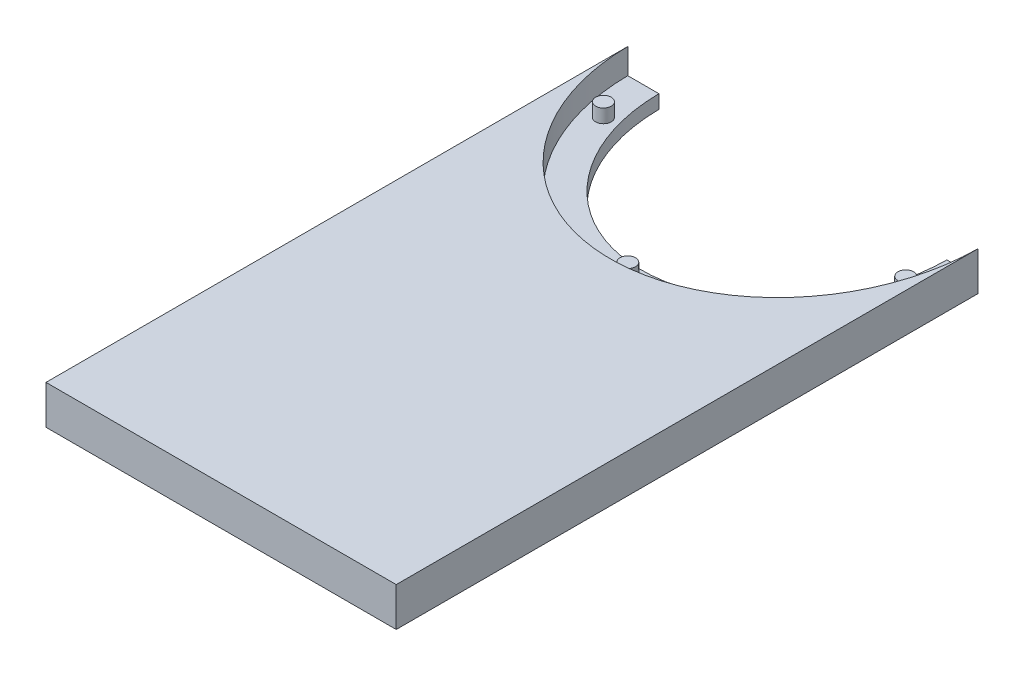
ISO-10303-21;
HEADER;
FILE_DESCRIPTION(('STEP AP214'),'2;1');
FILE_NAME('part.step','',(''),(''),'','','');
FILE_SCHEMA(('AUTOMOTIVE_DESIGN { 1 0 10303 214 1 1 1 1 }'));
ENDSEC;
DATA;
#1=APPLICATION_CONTEXT('core data for automotive mechanical design processes');
#2=APPLICATION_PROTOCOL_DEFINITION('international standard','automotive_design',2000,#1);
#3=PRODUCT_CONTEXT('',#1,'mechanical');
#4=PRODUCT('Part','Part','',(#3));
#5=PRODUCT_RELATED_PRODUCT_CATEGORY('part','',(#4));
#6=PRODUCT_DEFINITION_FORMATION('','',#4);
#7=PRODUCT_DEFINITION_CONTEXT('part definition',#1,'design');
#8=PRODUCT_DEFINITION('design','',#6,#7);
#9=PRODUCT_DEFINITION_SHAPE('','',#8);
#10=(LENGTH_UNIT() NAMED_UNIT(*) SI_UNIT(.MILLI.,.METRE.));
#11=(NAMED_UNIT(*) PLANE_ANGLE_UNIT() SI_UNIT($,.RADIAN.));
#12=(NAMED_UNIT(*) SI_UNIT($,.STERADIAN.) SOLID_ANGLE_UNIT());
#13=UNCERTAINTY_MEASURE_WITH_UNIT(LENGTH_MEASURE(1.E-05),#10,'distance_accuracy_value','');
#14=(GEOMETRIC_REPRESENTATION_CONTEXT(3) GLOBAL_UNCERTAINTY_ASSIGNED_CONTEXT((#13)) GLOBAL_UNIT_ASSIGNED_CONTEXT((#10,
#11,#12)) REPRESENTATION_CONTEXT('',''));
#15=CARTESIAN_POINT('',(0.,0.,0.));
#16=DIRECTION('',(0.,0.,1.));
#17=DIRECTION('',(1.,0.,0.));
#18=AXIS2_PLACEMENT_3D('',#15,#16,#17);
#19=CARTESIAN_POINT('',(0.,10.,0.));
#20=DIRECTION('',(0.,1.,0.));
#21=DIRECTION('',(0.,0.,1.));
#22=AXIS2_PLACEMENT_3D('',#19,#20,#21);
#23=ELLIPSE('',#22,50.,45.);
#24=DIRECTION('',(0.,-1.,0.));
#25=VECTOR('',#24,1.);
#26=SURFACE_OF_LINEAR_EXTRUSION('',#23,#25);
#27=CARTESIAN_POINT('',(0.,3.5,0.));
#28=DIRECTION('',(0.,1.,0.));
#29=DIRECTION('',(0.,0.,1.));
#30=AXIS2_PLACEMENT_3D('',#27,#28,#29);
#31=ELLIPSE('',#30,50.,45.);
#32=CARTESIAN_POINT('',(-44.9977499437472,3.5,0.5));
#33=VERTEX_POINT('',#32);
#34=CARTESIAN_POINT('',(44.9977499437472,3.5,0.5));
#35=VERTEX_POINT('',#34);
#36=EDGE_CURVE('E156',#33,#35,#31,.T.);
#37=ORIENTED_EDGE('',*,*,#36,.F.);
#38=DIRECTION('',(0.,-1.,0.));
#39=VECTOR('',#38,1.);
#40=CARTESIAN_POINT('',(-44.9977499437472,10.,0.5));
#41=LINE('',#40,#39);
#42=CARTESIAN_POINT('',(-44.9977499437472,10.,0.5));
#43=VERTEX_POINT('',#42);
#44=EDGE_CURVE('E55',#43,#33,#41,.T.);
#45=ORIENTED_EDGE('',*,*,#44,.F.);
#46=CARTESIAN_POINT('',(44.9977499437472,10.,0.5));
#47=VERTEX_POINT('',#46);
#48=EDGE_CURVE('E245',#43,#47,#23,.T.);
#49=ORIENTED_EDGE('',*,*,#48,.T.);
#50=DIRECTION('',(0.,-1.,0.));
#51=VECTOR('',#50,1.);
#52=CARTESIAN_POINT('',(44.9977499437472,10.,0.5));
#53=LINE('',#52,#51);
#54=EDGE_CURVE('E63',#47,#35,#53,.T.);
#55=ORIENTED_EDGE('',*,*,#54,.T.);
#56=EDGE_LOOP('',(#37,#45,#49,#55));
#57=FACE_BOUND('',#56,.T.);
#58=ADVANCED_FACE('F45',(#57),#26,.T.);
#59=CARTESIAN_POINT('',(0.,10.,0.5));
#60=DIRECTION('',(0.,0.,-1.));
#61=DIRECTION('',(-1.,0.,0.));
#62=AXIS2_PLACEMENT_3D('',#59,#60,#61);
#63=PLANE('',#62);
#64=DIRECTION('',(1.,0.,0.));
#65=VECTOR('',#64,1.);
#66=CARTESIAN_POINT('',(0.,0.,0.5));
#67=LINE('',#66,#65);
#68=CARTESIAN_POINT('',(-45.,0.,0.5));
#69=VERTEX_POINT('',#68);
#70=CARTESIAN_POINT('',(-36.9973577680352,0.,0.5));
#71=VERTEX_POINT('',#70);
#72=EDGE_CURVE('E134',#69,#71,#67,.T.);
#73=ORIENTED_EDGE('',*,*,#72,.F.);
#74=DIRECTION('',(0.,-1.,0.));
#75=VECTOR('',#74,1.);
#76=CARTESIAN_POINT('',(-45.,10.,0.5));
#77=LINE('',#76,#75);
#78=CARTESIAN_POINT('',(-45.,10.,0.5));
#79=VERTEX_POINT('',#78);
#80=EDGE_CURVE('E232',#79,#69,#77,.T.);
#81=ORIENTED_EDGE('',*,*,#80,.F.);
#82=DIRECTION('',(1.,0.,0.));
#83=VECTOR('',#82,1.);
#84=CARTESIAN_POINT('',(0.,10.,0.5));
#85=LINE('',#84,#83);
#86=EDGE_CURVE('E131',#79,#43,#85,.T.);
#87=ORIENTED_EDGE('',*,*,#86,.T.);
#88=ORIENTED_EDGE('',*,*,#44,.T.);
#89=DIRECTION('',(1.,0.,0.));
#90=VECTOR('',#89,1.);
#91=CARTESIAN_POINT('',(0.,3.5,0.5));
#92=LINE('',#91,#90);
#93=CARTESIAN_POINT('',(-36.9973577680352,3.5,0.5));
#94=VERTEX_POINT('',#93);
#95=EDGE_CURVE('E161',#33,#94,#92,.T.);
#96=ORIENTED_EDGE('',*,*,#95,.T.);
#97=DIRECTION('',(0.,-1.,0.));
#98=VECTOR('',#97,1.);
#99=CARTESIAN_POINT('',(-36.9973577680352,3.5,0.5));
#100=LINE('',#99,#98);
#101=EDGE_CURVE('E160',#94,#71,#100,.T.);
#102=ORIENTED_EDGE('',*,*,#101,.T.);
#103=EDGE_LOOP('',(#73,#81,#87,#88,#96,#102));
#104=FACE_BOUND('',#103,.T.);
#105=ADVANCED_FACE('F207',(#104),#63,.T.);
#106=CARTESIAN_POINT('',(-45.,10.,0.));
#107=DIRECTION('',(-1.,0.,0.));
#108=DIRECTION('',(0.,0.,1.));
#109=AXIS2_PLACEMENT_3D('',#106,#107,#108);
#110=PLANE('',#109);
#111=DIRECTION('',(0.,0.,-1.));
#112=VECTOR('',#111,1.);
#113=CARTESIAN_POINT('',(-45.,0.,0.));
#114=LINE('',#113,#112);
#115=CARTESIAN_POINT('',(-45.,0.,150.));
#116=VERTEX_POINT('',#115);
#117=EDGE_CURVE('E138',#116,#69,#114,.T.);
#118=ORIENTED_EDGE('',*,*,#117,.F.);
#119=DIRECTION('',(0.,-1.,0.));
#120=VECTOR('',#119,1.);
#121=CARTESIAN_POINT('',(-45.,10.,150.));
#122=LINE('',#121,#120);
#123=CARTESIAN_POINT('',(-45.,10.,150.));
#124=VERTEX_POINT('',#123);
#125=EDGE_CURVE('E123',#124,#116,#122,.T.);
#126=ORIENTED_EDGE('',*,*,#125,.F.);
#127=DIRECTION('',(0.,0.,-1.));
#128=VECTOR('',#127,1.);
#129=CARTESIAN_POINT('',(-45.,10.,0.));
#130=LINE('',#129,#128);
#131=EDGE_CURVE('E115',#124,#79,#130,.T.);
#132=ORIENTED_EDGE('',*,*,#131,.T.);
#133=ORIENTED_EDGE('',*,*,#80,.T.);
#134=EDGE_LOOP('',(#118,#126,#132,#133));
#135=FACE_BOUND('',#134,.T.);
#136=ADVANCED_FACE('F211',(#135),#110,.T.);
#137=CARTESIAN_POINT('',(0.,10.,150.));
#138=DIRECTION('',(0.,0.,-1.));
#139=DIRECTION('',(-1.,0.,0.));
#140=AXIS2_PLACEMENT_3D('',#137,#138,#139);
#141=PLANE('',#140);
#142=DIRECTION('',(1.,0.,0.));
#143=VECTOR('',#142,1.);
#144=CARTESIAN_POINT('',(0.,0.,150.));
#145=LINE('',#144,#143);
#146=CARTESIAN_POINT('',(45.,0.,150.));
#147=VERTEX_POINT('',#146);
#148=EDGE_CURVE('E81',#116,#147,#145,.T.);
#149=ORIENTED_EDGE('',*,*,#148,.T.);
#150=DIRECTION('',(0.,-1.,0.));
#151=VECTOR('',#150,1.);
#152=CARTESIAN_POINT('',(45.,10.,150.));
#153=LINE('',#152,#151);
#154=CARTESIAN_POINT('',(45.,10.,150.));
#155=VERTEX_POINT('',#154);
#156=EDGE_CURVE('E118',#155,#147,#153,.T.);
#157=ORIENTED_EDGE('',*,*,#156,.F.);
#158=DIRECTION('',(1.,0.,0.));
#159=VECTOR('',#158,1.);
#160=CARTESIAN_POINT('',(0.,10.,150.));
#161=LINE('',#160,#159);
#162=EDGE_CURVE('E108',#124,#155,#161,.T.);
#163=ORIENTED_EDGE('',*,*,#162,.F.);
#164=ORIENTED_EDGE('',*,*,#125,.T.);
#165=EDGE_LOOP('',(#149,#157,#163,#164));
#166=FACE_BOUND('',#165,.T.);
#167=ADVANCED_FACE('F119',(#166),#141,.F.);
#168=CARTESIAN_POINT('',(45.,10.,0.));
#169=DIRECTION('',(-1.,0.,0.));
#170=DIRECTION('',(0.,0.,1.));
#171=AXIS2_PLACEMENT_3D('',#168,#169,#170);
#172=PLANE('',#171);
#173=DIRECTION('',(0.,0.,-1.));
#174=VECTOR('',#173,1.);
#175=CARTESIAN_POINT('',(45.,0.,0.));
#176=LINE('',#175,#174);
#177=CARTESIAN_POINT('',(45.,0.,0.5));
#178=VERTEX_POINT('',#177);
#179=EDGE_CURVE('E146',#147,#178,#176,.T.);
#180=ORIENTED_EDGE('',*,*,#179,.T.);
#181=DIRECTION('',(0.,-1.,0.));
#182=VECTOR('',#181,1.);
#183=CARTESIAN_POINT('',(45.,10.,0.5));
#184=LINE('',#183,#182);
#185=CARTESIAN_POINT('',(45.,10.,0.5));
#186=VERTEX_POINT('',#185);
#187=EDGE_CURVE('E87',#186,#178,#184,.T.);
#188=ORIENTED_EDGE('',*,*,#187,.F.);
#189=DIRECTION('',(0.,0.,-1.));
#190=VECTOR('',#189,1.);
#191=CARTESIAN_POINT('',(45.,10.,0.));
#192=LINE('',#191,#190);
#193=EDGE_CURVE('E112',#155,#186,#192,.T.);
#194=ORIENTED_EDGE('',*,*,#193,.F.);
#195=ORIENTED_EDGE('',*,*,#156,.T.);
#196=EDGE_LOOP('',(#180,#188,#194,#195));
#197=FACE_BOUND('',#196,.T.);
#198=ADVANCED_FACE('F125',(#197),#172,.F.);
#199=CARTESIAN_POINT('',(36.9973577680352,0.,0.5));
#200=VERTEX_POINT('',#199);
#201=EDGE_CURVE('E140',#200,#178,#67,.T.);
#202=ORIENTED_EDGE('',*,*,#201,.F.);
#203=DIRECTION('',(0.,-1.,0.));
#204=VECTOR('',#203,1.);
#205=CARTESIAN_POINT('',(36.9973577680352,3.5,0.5));
#206=LINE('',#205,#204);
#207=CARTESIAN_POINT('',(36.9973577680352,3.5,0.5));
#208=VERTEX_POINT('',#207);
#209=EDGE_CURVE('E139',#208,#200,#206,.T.);
#210=ORIENTED_EDGE('',*,*,#209,.F.);
#211=EDGE_CURVE('E169',#208,#35,#92,.T.);
#212=ORIENTED_EDGE('',*,*,#211,.T.);
#213=ORIENTED_EDGE('',*,*,#54,.F.);
#214=EDGE_CURVE('E127',#47,#186,#85,.T.);
#215=ORIENTED_EDGE('',*,*,#214,.T.);
#216=ORIENTED_EDGE('',*,*,#187,.T.);
#217=EDGE_LOOP('',(#202,#210,#212,#213,#215,#216));
#218=FACE_BOUND('',#217,.T.);
#219=ADVANCED_FACE('F201',(#218),#63,.T.);
#220=CARTESIAN_POINT('',(0.,10.,0.));
#221=DIRECTION('',(0.,1.,0.));
#222=DIRECTION('',(0.,0.,1.));
#223=AXIS2_PLACEMENT_3D('',#220,#221,#222);
#224=PLANE('',#223);
#225=ORIENTED_EDGE('',*,*,#48,.F.);
#226=ORIENTED_EDGE('',*,*,#86,.F.);
#227=ORIENTED_EDGE('',*,*,#131,.F.);
#228=ORIENTED_EDGE('',*,*,#162,.T.);
#229=ORIENTED_EDGE('',*,*,#193,.T.);
#230=ORIENTED_EDGE('',*,*,#214,.F.);
#231=EDGE_LOOP('',(#225,#226,#227,#228,#229,#230));
#232=FACE_BOUND('',#231,.T.);
#233=ADVANCED_FACE('F109',(#232),#224,.T.);
#234=CARTESIAN_POINT('',(0.,0.,0.));
#235=DIRECTION('',(0.,1.,0.));
#236=DIRECTION('',(0.,0.,1.));
#237=AXIS2_PLACEMENT_3D('',#234,#235,#236);
#238=PLANE('',#237);
#239=ORIENTED_EDGE('',*,*,#72,.T.);
#240=CARTESIAN_POINT('',(0.,0.,-42.));
#241=CARTESIAN_POINT('',(-4.93138164351082,0.,-42.));
#242=CARTESIAN_POINT('',(-14.7941449305325,0.,-39.7237391442364));
#243=CARTESIAN_POINT('',(-27.0896008441229,0.,-30.2004855000218));
#244=CARTESIAN_POINT('',(-35.1368792596779,0.,-16.2564691599312));
#245=CARTESIAN_POINT('',(-37.931560370161,0.,0.));
#246=CARTESIAN_POINT('',(-35.1368792596779,0.,16.2564691599312));
#247=CARTESIAN_POINT('',(-27.0896008441229,0.,30.2004855000218));
#248=CARTESIAN_POINT('',(-14.7941449305325,0.,39.7237391442364));
#249=CARTESIAN_POINT('',(0.,0.,43.1381304278818));
#250=CARTESIAN_POINT('',(14.7941449305325,0.,39.7237391442364));
#251=CARTESIAN_POINT('',(27.0896008441229,0.,30.2004855000219));
#252=CARTESIAN_POINT('',(35.1368792596779,0.,16.2564691599312));
#253=CARTESIAN_POINT('',(37.931560370161,0.,0.));
#254=CARTESIAN_POINT('',(35.1368792596779,0.,-16.2564691599312));
#255=CARTESIAN_POINT('',(27.0896008441229,0.,-30.2004855000218));
#256=CARTESIAN_POINT('',(14.7941449305325,0.,-39.7237391442364));
#257=CARTESIAN_POINT('',(4.93138164351083,0.,-42.));
#258=CARTESIAN_POINT('',(0.,0.,-42.));
#259=B_SPLINE_CURVE_WITH_KNOTS('',3,(#240,#241,#242,#243,#244,#245,#246,#247,#248,#249,#250,
#251,#252,#253,#254,#255,#256,#257,#258),.UNSPECIFIED.,.T.,.F.,(4,1,1,1,1,1,1,1,1,1,1,1,1,1,1,1,
4),(0.,0.392699081698724,0.785398163397448,1.17809724509617,1.5707963267949,1.96349540849362,
2.35619449019234,2.74889357189107,3.14159265358979,3.53429173528852,3.92699081698724,
4.31968989868597,4.71238898038469,5.10508806208341,5.49778714378214,5.89048622548086,
6.28318530717959),.UNSPECIFIED.);
#260=EDGE_CURVE('E183',#71,#200,#259,.T.);
#261=ORIENTED_EDGE('',*,*,#260,.T.);
#262=ORIENTED_EDGE('',*,*,#201,.T.);
#263=ORIENTED_EDGE('',*,*,#179,.F.);
#264=ORIENTED_EDGE('',*,*,#148,.F.);
#265=ORIENTED_EDGE('',*,*,#117,.T.);
#266=EDGE_LOOP('',(#239,#261,#262,#263,#264,#265));
#267=FACE_BOUND('',#266,.T.);
#268=ADVANCED_FACE('F196',(#267),#238,.F.);
#269=CARTESIAN_POINT('',(0.,3.5,-42.));
#270=CARTESIAN_POINT('',(-4.93138164351082,3.5,-42.));
#271=CARTESIAN_POINT('',(-14.7941449305325,3.5,-39.7237391442364));
#272=CARTESIAN_POINT('',(-27.0896008441229,3.5,-30.2004855000218));
#273=CARTESIAN_POINT('',(-35.1368792596779,3.5,-16.2564691599312));
#274=CARTESIAN_POINT('',(-37.931560370161,3.5,0.));
#275=CARTESIAN_POINT('',(-35.1368792596779,3.5,16.2564691599312));
#276=CARTESIAN_POINT('',(-27.0896008441229,3.5,30.2004855000218));
#277=CARTESIAN_POINT('',(-14.7941449305325,3.5,39.7237391442364));
#278=CARTESIAN_POINT('',(0.,3.5,43.1381304278818));
#279=CARTESIAN_POINT('',(14.7941449305325,3.5,39.7237391442364));
#280=CARTESIAN_POINT('',(27.0896008441229,3.5,30.2004855000219));
#281=CARTESIAN_POINT('',(35.1368792596779,3.5,16.2564691599312));
#282=CARTESIAN_POINT('',(37.931560370161,3.5,0.));
#283=CARTESIAN_POINT('',(35.1368792596779,3.5,-16.2564691599312));
#284=CARTESIAN_POINT('',(27.0896008441229,3.5,-30.2004855000218));
#285=CARTESIAN_POINT('',(14.7941449305325,3.5,-39.7237391442364));
#286=CARTESIAN_POINT('',(4.93138164351083,3.5,-42.));
#287=CARTESIAN_POINT('',(0.,3.5,-42.));
#288=B_SPLINE_CURVE_WITH_KNOTS('',3,(#269,#270,#271,#272,#273,#274,#275,#276,#277,#278,#279,
#280,#281,#282,#283,#284,#285,#286,#287),.UNSPECIFIED.,.T.,.F.,(4,1,1,1,1,1,1,1,1,1,1,1,1,1,1,1,
4),(0.,0.392699081698724,0.785398163397448,1.17809724509617,1.5707963267949,1.96349540849362,
2.35619449019234,2.74889357189107,3.14159265358979,3.53429173528852,3.92699081698724,
4.31968989868597,4.71238898038469,5.10508806208341,5.49778714378214,5.89048622548086,
6.28318530717959),.UNSPECIFIED.);
#289=DIRECTION('',(0.,-1.,0.));
#290=VECTOR('',#289,1.);
#291=SURFACE_OF_LINEAR_EXTRUSION('',#288,#290);
#292=ORIENTED_EDGE('',*,*,#260,.F.);
#293=ORIENTED_EDGE('',*,*,#101,.F.);
#294=EDGE_CURVE('E168',#94,#208,#288,.T.);
#295=ORIENTED_EDGE('',*,*,#294,.T.);
#296=ORIENTED_EDGE('',*,*,#209,.T.);
#297=EDGE_LOOP('',(#292,#293,#295,#296));
#298=FACE_BOUND('',#297,.T.);
#299=ADVANCED_FACE('F191',(#298),#291,.T.);
#300=CARTESIAN_POINT('',(0.,3.5,0.));
#301=DIRECTION('',(0.,1.,0.));
#302=DIRECTION('',(0.,0.,1.));
#303=AXIS2_PLACEMENT_3D('',#300,#301,#302);
#304=PLANE('',#303);
#305=CARTESIAN_POINT('',(38.8404838015386,3.5,12.9089643673815));
#306=DIRECTION('',(0.,1.,0.));
#307=DIRECTION('',(0.,0.,1.));
#308=AXIS2_PLACEMENT_3D('',#305,#306,#307);
#309=CIRCLE('',#308,2.);
#310=CARTESIAN_POINT('',(38.8404838015386,3.5,14.9089643673815));
#311=VERTEX_POINT('',#310);
#312=EDGE_CURVE('E11',#311,#311,#309,.T.);
#313=ORIENTED_EDGE('',*,*,#312,.F.);
#314=EDGE_LOOP('',(#313));
#315=FACE_BOUND('',#314,.T.);
#316=CARTESIAN_POINT('',(0.,3.5,45.5));
#317=DIRECTION('',(0.,1.,0.));
#318=DIRECTION('',(0.,0.,1.));
#319=AXIS2_PLACEMENT_3D('',#316,#317,#318);
#320=CIRCLE('',#319,2.);
#321=CARTESIAN_POINT('',(0.,3.5,47.5));
#322=VERTEX_POINT('',#321);
#323=EDGE_CURVE('E265',#322,#322,#320,.F.);
#324=ORIENTED_EDGE('',*,*,#323,.T.);
#325=EDGE_LOOP('',(#324));
#326=FACE_BOUND('',#325,.T.);
#327=CARTESIAN_POINT('',(-38.8404838015386,3.5,12.9089643673815));
#328=DIRECTION('',(0.,1.,0.));
#329=DIRECTION('',(0.,0.,1.));
#330=AXIS2_PLACEMENT_3D('',#327,#328,#329);
#331=CIRCLE('',#330,2.);
#332=CARTESIAN_POINT('',(-38.8404838015386,3.5,14.9089643673815));
#333=VERTEX_POINT('',#332);
#334=EDGE_CURVE('E257',#333,#333,#331,.F.);
#335=ORIENTED_EDGE('',*,*,#334,.T.);
#336=EDGE_LOOP('',(#335));
#337=FACE_BOUND('',#336,.T.);
#338=ORIENTED_EDGE('',*,*,#211,.F.);
#339=ORIENTED_EDGE('',*,*,#294,.F.);
#340=ORIENTED_EDGE('',*,*,#95,.F.);
#341=ORIENTED_EDGE('',*,*,#36,.T.);
#342=EDGE_LOOP('',(#338,#339,#340,#341));
#343=FACE_BOUND('',#342,.T.);
#344=ADVANCED_FACE('F195',(#315,#326,#337,#343),#304,.T.);
#345=CARTESIAN_POINT('',(-38.8404838015386,7.,12.9089643673815));
#346=DIRECTION('',(0.,-1.,0.));
#347=DIRECTION('',(0.,0.,-1.));
#348=AXIS2_PLACEMENT_3D('',#345,#346,#347);
#349=CYLINDRICAL_SURFACE('',#348,2.);
#350=ORIENTED_EDGE('',*,*,#334,.F.);
#351=EDGE_LOOP('',(#350));
#352=FACE_BOUND('',#351,.T.);
#353=CARTESIAN_POINT('',(-38.8404838015386,7.,12.9089643673815));
#354=DIRECTION('',(0.,1.,0.));
#355=DIRECTION('',(0.,0.,1.));
#356=AXIS2_PLACEMENT_3D('',#353,#354,#355);
#357=CIRCLE('',#356,2.);
#358=CARTESIAN_POINT('',(-38.8404838015386,7.,14.9089643673815));
#359=VERTEX_POINT('',#358);
#360=EDGE_CURVE('E174',#359,#359,#357,.T.);
#361=ORIENTED_EDGE('',*,*,#360,.F.);
#362=EDGE_LOOP('',(#361));
#363=FACE_BOUND('',#362,.T.);
#364=ADVANCED_FACE('F301',(#352,#363),#349,.T.);
#365=CARTESIAN_POINT('',(-38.8404838015386,7.,12.9089643673815));
#366=DIRECTION('',(0.,1.,0.));
#367=DIRECTION('',(0.,0.,1.));
#368=AXIS2_PLACEMENT_3D('',#365,#366,#367);
#369=PLANE('',#368);
#370=ORIENTED_EDGE('',*,*,#360,.T.);
#371=EDGE_LOOP('',(#370));
#372=FACE_BOUND('',#371,.T.);
#373=ADVANCED_FACE('F296',(#372),#369,.T.);
#374=CARTESIAN_POINT('',(0.,7.,45.5));
#375=DIRECTION('',(0.,-1.,0.));
#376=DIRECTION('',(0.,0.,-1.));
#377=AXIS2_PLACEMENT_3D('',#374,#375,#376);
#378=CYLINDRICAL_SURFACE('',#377,2.);
#379=ORIENTED_EDGE('',*,*,#323,.F.);
#380=EDGE_LOOP('',(#379));
#381=FACE_BOUND('',#380,.T.);
#382=CARTESIAN_POINT('',(0.,7.,45.5));
#383=DIRECTION('',(0.,1.,0.));
#384=DIRECTION('',(0.,0.,1.));
#385=AXIS2_PLACEMENT_3D('',#382,#383,#384);
#386=CIRCLE('',#385,2.);
#387=CARTESIAN_POINT('',(0.,7.,47.5));
#388=VERTEX_POINT('',#387);
#389=EDGE_CURVE('E268',#388,#388,#386,.T.);
#390=ORIENTED_EDGE('',*,*,#389,.F.);
#391=EDGE_LOOP('',(#390));
#392=FACE_BOUND('',#391,.T.);
#393=ADVANCED_FACE('F293',(#381,#392),#378,.T.);
#394=CARTESIAN_POINT('',(0.,7.,45.5));
#395=DIRECTION('',(0.,1.,0.));
#396=DIRECTION('',(0.,0.,1.));
#397=AXIS2_PLACEMENT_3D('',#394,#395,#396);
#398=PLANE('',#397);
#399=ORIENTED_EDGE('',*,*,#389,.T.);
#400=EDGE_LOOP('',(#399));
#401=FACE_BOUND('',#400,.T.);
#402=ADVANCED_FACE('F289',(#401),#398,.T.);
#403=CARTESIAN_POINT('',(38.8404838015386,7.,12.9089643673815));
#404=DIRECTION('',(0.,-1.,0.));
#405=DIRECTION('',(0.,0.,-1.));
#406=AXIS2_PLACEMENT_3D('',#403,#404,#405);
#407=CYLINDRICAL_SURFACE('',#406,2.);
#408=ORIENTED_EDGE('',*,*,#312,.T.);
#409=EDGE_LOOP('',(#408));
#410=FACE_BOUND('',#409,.T.);
#411=CARTESIAN_POINT('',(38.8404838015386,7.,12.9089643673815));
#412=DIRECTION('',(0.,-1.,0.));
#413=DIRECTION('',(0.,0.,-1.));
#414=AXIS2_PLACEMENT_3D('',#411,#412,#413);
#415=CIRCLE('',#414,2.);
#416=CARTESIAN_POINT('',(38.8404838015386,7.,10.9089643673815));
#417=VERTEX_POINT('',#416);
#418=EDGE_CURVE('E273',#417,#417,#415,.T.);
#419=ORIENTED_EDGE('',*,*,#418,.T.);
#420=EDGE_LOOP('',(#419));
#421=FACE_BOUND('',#420,.T.);
#422=ADVANCED_FACE('F281',(#410,#421),#407,.T.);
#423=CARTESIAN_POINT('',(38.8404838015386,7.,12.9089643673815));
#424=DIRECTION('',(0.,-1.,0.));
#425=DIRECTION('',(0.,0.,-1.));
#426=AXIS2_PLACEMENT_3D('',#423,#424,#425);
#427=PLANE('',#426);
#428=ORIENTED_EDGE('',*,*,#418,.F.);
#429=EDGE_LOOP('',(#428));
#430=FACE_BOUND('',#429,.T.);
#431=ADVANCED_FACE('F283',(#430),#427,.F.);
#432=CLOSED_SHELL('',(#58,#105,#136,#167,#198,#219,#233,#268,#299,#344,#364,#373,#393,#402,#422,#431));
#433=MANIFOLD_SOLID_BREP('B2',#432);
#434=ADVANCED_BREP_SHAPE_REPRESENTATION('',(#18,#433),#14);
#435=SHAPE_DEFINITION_REPRESENTATION(#9,#434);
ENDSEC;
END-ISO-10303-21;
